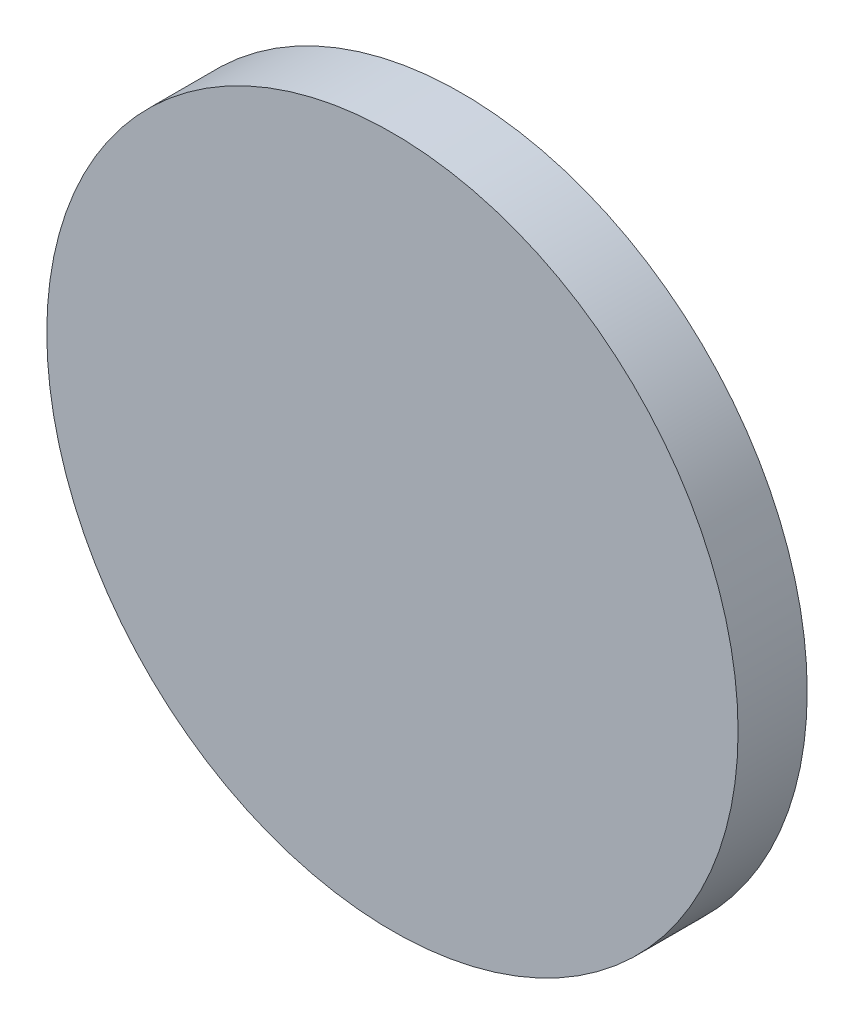
ISO-10303-21;
HEADER;
FILE_DESCRIPTION(('STEP AP214'),'2;1');
FILE_NAME('part.step','',(''),(''),'','','');
FILE_SCHEMA(('AUTOMOTIVE_DESIGN { 1 0 10303 214 1 1 1 1 }'));
ENDSEC;
DATA;
#1=APPLICATION_CONTEXT('core data for automotive mechanical design processes');
#2=APPLICATION_PROTOCOL_DEFINITION('international standard','automotive_design',2000,#1);
#3=PRODUCT_CONTEXT('',#1,'mechanical');
#4=PRODUCT('Part','Part','',(#3));
#5=PRODUCT_RELATED_PRODUCT_CATEGORY('part','',(#4));
#6=PRODUCT_DEFINITION_FORMATION('','',#4);
#7=PRODUCT_DEFINITION_CONTEXT('part definition',#1,'design');
#8=PRODUCT_DEFINITION('design','',#6,#7);
#9=PRODUCT_DEFINITION_SHAPE('','',#8);
#10=(LENGTH_UNIT() NAMED_UNIT(*) SI_UNIT(.MILLI.,.METRE.));
#11=(NAMED_UNIT(*) PLANE_ANGLE_UNIT() SI_UNIT($,.RADIAN.));
#12=(NAMED_UNIT(*) SI_UNIT($,.STERADIAN.) SOLID_ANGLE_UNIT());
#13=UNCERTAINTY_MEASURE_WITH_UNIT(LENGTH_MEASURE(1.E-05),#10,'distance_accuracy_value','');
#14=(GEOMETRIC_REPRESENTATION_CONTEXT(3) GLOBAL_UNCERTAINTY_ASSIGNED_CONTEXT((#13)) GLOBAL_UNIT_ASSIGNED_CONTEXT((#10,
#11,#12)) REPRESENTATION_CONTEXT('',''));
#15=CARTESIAN_POINT('',(0.,0.,0.));
#16=DIRECTION('',(0.,0.,1.));
#17=DIRECTION('',(1.,0.,0.));
#18=AXIS2_PLACEMENT_3D('',#15,#16,#17);
#19=CARTESIAN_POINT('',(0.,0.,0.));
#20=DIRECTION('',(0.,0.,-1.));
#21=DIRECTION('',(1.,0.,0.));
#22=AXIS2_PLACEMENT_3D('',#19,#20,#21);
#23=CYLINDRICAL_SURFACE('',#22,0.1999996);
#24=CARTESIAN_POINT('',(0.,0.,0.));
#25=DIRECTION('',(0.,0.,1.));
#26=DIRECTION('',(1.,0.,0.));
#27=AXIS2_PLACEMENT_3D('',#24,#25,#26);
#28=CIRCLE('',#27,0.1999996);
#29=CARTESIAN_POINT('',(0.1999996,0.,0.));
#30=VERTEX_POINT('',#29);
#31=EDGE_CURVE('E11',#30,#30,#28,.T.);
#32=ORIENTED_EDGE('',*,*,#31,.T.);
#33=DIRECTION('',(0.,0.,1.));
#34=VECTOR('',#33,1.);
#35=CARTESIAN_POINT('',(0.1999996,0.,0.));
#36=LINE('',#35,#34);
#37=CARTESIAN_POINT('',(0.1999996,0.,0.03999992));
#38=VERTEX_POINT('',#37);
#39=EDGE_CURVE('E24',#30,#38,#36,.T.);
#40=ORIENTED_EDGE('',*,*,#39,.T.);
#41=CARTESIAN_POINT('',(0.,0.,0.03999992));
#42=DIRECTION('',(0.,0.,1.));
#43=DIRECTION('',(1.,0.,0.));
#44=AXIS2_PLACEMENT_3D('',#41,#42,#43);
#45=CIRCLE('',#44,0.1999996);
#46=EDGE_CURVE('E32',#38,#38,#45,.T.);
#47=ORIENTED_EDGE('',*,*,#46,.F.);
#48=ORIENTED_EDGE('',*,*,#39,.F.);
#49=EDGE_LOOP('',(#32,#40,#47,#48));
#50=FACE_BOUND('',#49,.T.);
#51=ADVANCED_FACE('F17',(#50),#23,.T.);
#52=CARTESIAN_POINT('',(0.1999996,0.,0.));
#53=DIRECTION('',(0.,0.,-1.));
#54=DIRECTION('',(-1.,0.,0.));
#55=AXIS2_PLACEMENT_3D('',#52,#53,#54);
#56=PLANE('',#55);
#57=ORIENTED_EDGE('',*,*,#31,.F.);
#58=EDGE_LOOP('',(#57));
#59=FACE_BOUND('',#58,.T.);
#60=ADVANCED_FACE('F37',(#59),#56,.T.);
#61=CARTESIAN_POINT('',(0.1999996,0.,0.03999992));
#62=DIRECTION('',(0.,0.,-1.));
#63=DIRECTION('',(-1.,0.,0.));
#64=AXIS2_PLACEMENT_3D('',#61,#62,#63);
#65=PLANE('',#64);
#66=ORIENTED_EDGE('',*,*,#46,.T.);
#67=EDGE_LOOP('',(#66));
#68=FACE_BOUND('',#67,.T.);
#69=ADVANCED_FACE('F34',(#68),#65,.F.);
#70=CLOSED_SHELL('',(#51,#60,#69));
#71=MANIFOLD_SOLID_BREP('B1',#70);
#72=ADVANCED_BREP_SHAPE_REPRESENTATION('',(#18,#71),#14);
#73=SHAPE_DEFINITION_REPRESENTATION(#9,#72);
ENDSEC;
END-ISO-10303-21;
